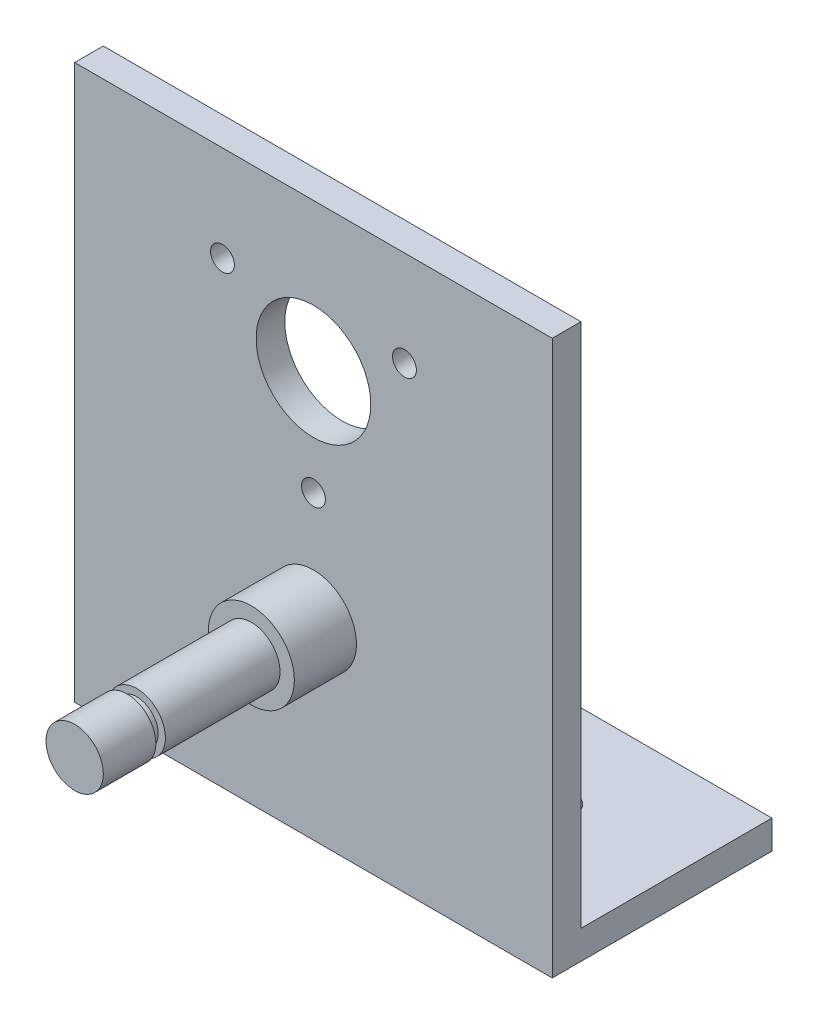
ISO-10303-21;
HEADER;
FILE_DESCRIPTION(('STEP AP214'),'2;1');
FILE_NAME('part.step','',(''),(''),'','','');
FILE_SCHEMA(('AUTOMOTIVE_DESIGN { 1 0 10303 214 1 1 1 1 }'));
ENDSEC;
DATA;
#1=APPLICATION_CONTEXT('core data for automotive mechanical design processes');
#2=APPLICATION_PROTOCOL_DEFINITION('international standard','automotive_design',2000,#1);
#3=PRODUCT_CONTEXT('',#1,'mechanical');
#4=PRODUCT('Part','Part','',(#3));
#5=PRODUCT_RELATED_PRODUCT_CATEGORY('part','',(#4));
#6=PRODUCT_DEFINITION_FORMATION('','',#4);
#7=PRODUCT_DEFINITION_CONTEXT('part definition',#1,'design');
#8=PRODUCT_DEFINITION('design','',#6,#7);
#9=PRODUCT_DEFINITION_SHAPE('','',#8);
#10=(LENGTH_UNIT() NAMED_UNIT(*) SI_UNIT(.MILLI.,.METRE.));
#11=(NAMED_UNIT(*) PLANE_ANGLE_UNIT() SI_UNIT($,.RADIAN.));
#12=(NAMED_UNIT(*) SI_UNIT($,.STERADIAN.) SOLID_ANGLE_UNIT());
#13=UNCERTAINTY_MEASURE_WITH_UNIT(LENGTH_MEASURE(1.E-05),#10,'distance_accuracy_value','');
#14=(GEOMETRIC_REPRESENTATION_CONTEXT(3) GLOBAL_UNCERTAINTY_ASSIGNED_CONTEXT((#13)) GLOBAL_UNIT_ASSIGNED_CONTEXT((#10,
#11,#12)) REPRESENTATION_CONTEXT('',''));
#15=CARTESIAN_POINT('',(0.,0.,0.));
#16=DIRECTION('',(0.,0.,1.));
#17=DIRECTION('',(1.,0.,0.));
#18=AXIS2_PLACEMENT_3D('',#15,#16,#17);
#19=CARTESIAN_POINT('',(-30.6196847846183,-1.48731281198003,28.));
#20=DIRECTION('',(0.,0.,-1.));
#21=DIRECTION('',(-1.,0.,0.));
#22=AXIS2_PLACEMENT_3D('',#19,#20,#21);
#23=CYLINDRICAL_SURFACE('',#22,3.);
#24=CARTESIAN_POINT('',(-30.6196847846183,-1.48731281198003,9.5));
#25=DIRECTION('',(0.,0.,1.));
#26=DIRECTION('',(1.,0.,0.));
#27=AXIS2_PLACEMENT_3D('',#24,#25,#26);
#28=CIRCLE('',#27,3.);
#29=CARTESIAN_POINT('',(-27.6196847846183,-1.48731281198003,9.5));
#30=VERTEX_POINT('',#29);
#31=EDGE_CURVE('E249',#30,#30,#28,.F.);
#32=ORIENTED_EDGE('',*,*,#31,.F.);
#33=EDGE_LOOP('',(#32));
#34=FACE_BOUND('',#33,.T.);
#35=CARTESIAN_POINT('',(-30.6196847846183,-1.48731281198003,21.5));
#36=DIRECTION('',(0.,0.,1.));
#37=DIRECTION('',(1.,0.,0.));
#38=AXIS2_PLACEMENT_3D('',#35,#36,#37);
#39=CIRCLE('',#38,3.);
#40=CARTESIAN_POINT('',(-27.6196847846183,-1.48731281198003,21.5));
#41=VERTEX_POINT('',#40);
#42=EDGE_CURVE('E246',#41,#41,#39,.T.);
#43=ORIENTED_EDGE('',*,*,#42,.F.);
#44=EDGE_LOOP('',(#43));
#45=FACE_BOUND('',#44,.T.);
#46=ADVANCED_FACE('F37',(#34,#45),#23,.T.);
#47=CARTESIAN_POINT('',(0.,0.,3.));
#48=DIRECTION('',(0.,0.,-1.));
#49=DIRECTION('',(-1.,0.,0.));
#50=AXIS2_PLACEMENT_3D('',#47,#48,#49);
#51=PLANE('',#50);
#52=CARTESIAN_POINT('',(-30.6196847846183,-1.48731281198003,2.9999999999859));
#53=DIRECTION('',(0.,0.,-1.));
#54=DIRECTION('',(-1.,0.,0.));
#55=AXIS2_PLACEMENT_3D('',#52,#53,#54);
#56=CIRCLE('',#55,4.5);
#57=CARTESIAN_POINT('',(-35.1196847846183,-1.48731281198003,2.9999999999859));
#58=VERTEX_POINT('',#57);
#59=EDGE_CURVE('E259',#58,#58,#56,.F.);
#60=ORIENTED_EDGE('',*,*,#59,.F.);
#61=EDGE_LOOP('',(#60));
#62=FACE_BOUND('',#61,.T.);
#63=CARTESIAN_POINT('',(-30.6196847846182,10.01268718802,3.));
#64=DIRECTION('',(0.,0.,1.));
#65=DIRECTION('',(1.,0.,0.));
#66=AXIS2_PLACEMENT_3D('',#63,#64,#65);
#67=CIRCLE('',#66,1.25);
#68=CARTESIAN_POINT('',(-29.3696847846182,10.01268718802,3.));
#69=VERTEX_POINT('',#68);
#70=EDGE_CURVE('E169',#69,#69,#67,.T.);
#71=ORIENTED_EDGE('',*,*,#70,.F.);
#72=EDGE_LOOP('',(#71));
#73=FACE_BOUND('',#72,.T.);
#74=CARTESIAN_POINT('',(-21.0934053429894,26.51268718802,3.));
#75=DIRECTION('',(0.,0.,1.));
#76=DIRECTION('',(1.,0.,0.));
#77=AXIS2_PLACEMENT_3D('',#74,#75,#76);
#78=CIRCLE('',#77,1.25);
#79=CARTESIAN_POINT('',(-19.8434053429894,26.51268718802,3.));
#80=VERTEX_POINT('',#79);
#81=EDGE_CURVE('E159',#80,#80,#78,.T.);
#82=ORIENTED_EDGE('',*,*,#81,.F.);
#83=EDGE_LOOP('',(#82));
#84=FACE_BOUND('',#83,.T.);
#85=CARTESIAN_POINT('',(-40.1459642262471,26.5126871880199,3.));
#86=DIRECTION('',(0.,0.,1.));
#87=DIRECTION('',(1.,0.,0.));
#88=AXIS2_PLACEMENT_3D('',#85,#86,#87);
#89=CIRCLE('',#88,1.25);
#90=CARTESIAN_POINT('',(-38.8959642262471,26.5126871880199,3.));
#91=VERTEX_POINT('',#90);
#92=EDGE_CURVE('E156',#91,#91,#89,.T.);
#93=ORIENTED_EDGE('',*,*,#92,.F.);
#94=EDGE_LOOP('',(#93));
#95=FACE_BOUND('',#94,.T.);
#96=CARTESIAN_POINT('',(-30.6196847846183,21.01268718802,3.));
#97=DIRECTION('',(0.,0.,1.));
#98=DIRECTION('',(1.,0.,0.));
#99=AXIS2_PLACEMENT_3D('',#96,#97,#98);
#100=CIRCLE('',#99,6.);
#101=CARTESIAN_POINT('',(-24.6196847846183,21.01268718802,3.));
#102=VERTEX_POINT('',#101);
#103=EDGE_CURVE('E152',#102,#102,#100,.T.);
#104=ORIENTED_EDGE('',*,*,#103,.F.);
#105=EDGE_LOOP('',(#104));
#106=FACE_BOUND('',#105,.T.);
#107=DIRECTION('',(0.,-1.,0.));
#108=VECTOR('',#107,1.);
#109=CARTESIAN_POINT('',(-55.6196847846183,-21.48731281198,3.));
#110=LINE('',#109,#108);
#111=CARTESIAN_POINT('',(-55.6196847846183,36.51268718802,3.));
#112=VERTEX_POINT('',#111);
#113=CARTESIAN_POINT('',(-55.6196847846183,-21.48731281198,3.));
#114=VERTEX_POINT('',#113);
#115=EDGE_CURVE('E133',#112,#114,#110,.T.);
#116=ORIENTED_EDGE('',*,*,#115,.T.);
#117=DIRECTION('',(1.,0.,0.));
#118=VECTOR('',#117,1.);
#119=CARTESIAN_POINT('',(-55.6196847846183,-21.48731281198,3.));
#120=LINE('',#119,#118);
#121=CARTESIAN_POINT('',(-5.61968478461826,-21.48731281198,3.));
#122=VERTEX_POINT('',#121);
#123=EDGE_CURVE('E85',#114,#122,#120,.T.);
#124=ORIENTED_EDGE('',*,*,#123,.T.);
#125=DIRECTION('',(0.,1.,0.));
#126=VECTOR('',#125,1.);
#127=CARTESIAN_POINT('',(-5.61968478461826,-21.48731281198,3.));
#128=LINE('',#127,#126);
#129=CARTESIAN_POINT('',(-5.61968478461826,36.51268718802,3.));
#130=VERTEX_POINT('',#129);
#131=EDGE_CURVE('E107',#122,#130,#128,.T.);
#132=ORIENTED_EDGE('',*,*,#131,.T.);
#133=DIRECTION('',(-1.,0.,0.));
#134=VECTOR('',#133,1.);
#135=CARTESIAN_POINT('',(-55.6196847846183,36.51268718802,3.));
#136=LINE('',#135,#134);
#137=EDGE_CURVE('E63',#130,#112,#136,.T.);
#138=ORIENTED_EDGE('',*,*,#137,.T.);
#139=EDGE_LOOP('',(#116,#124,#132,#138));
#140=FACE_BOUND('',#139,.T.);
#141=ADVANCED_FACE('F188',(#62,#73,#84,#95,#106,#140),#51,.F.);
#142=CARTESIAN_POINT('',(-55.6196847846183,-21.48731281198,3.));
#143=DIRECTION('',(1.,0.,0.));
#144=DIRECTION('',(0.,0.,-1.));
#145=AXIS2_PLACEMENT_3D('',#142,#143,#144);
#146=PLANE('',#145);
#147=DIRECTION('',(0.,-1.,0.));
#148=VECTOR('',#147,1.);
#149=CARTESIAN_POINT('',(-55.6196847846183,-21.48731281198,0.));
#150=LINE('',#149,#148);
#151=CARTESIAN_POINT('',(-55.6196847846183,36.51268718802,0.));
#152=VERTEX_POINT('',#151);
#153=CARTESIAN_POINT('',(-55.6196847846183,-18.48731281198,0.));
#154=VERTEX_POINT('',#153);
#155=EDGE_CURVE('E146',#152,#154,#150,.T.);
#156=ORIENTED_EDGE('',*,*,#155,.T.);
#157=DIRECTION('',(0.,0.,1.));
#158=VECTOR('',#157,1.);
#159=CARTESIAN_POINT('',(-55.6196847846183,-18.48731281198,-20.));
#160=LINE('',#159,#158);
#161=CARTESIAN_POINT('',(-55.6196847846183,-18.48731281198,-20.));
#162=VERTEX_POINT('',#161);
#163=EDGE_CURVE('E141',#162,#154,#160,.T.);
#164=ORIENTED_EDGE('',*,*,#163,.F.);
#165=DIRECTION('',(0.,1.,0.));
#166=VECTOR('',#165,1.);
#167=CARTESIAN_POINT('',(-55.6196847846183,-21.48731281198,-20.));
#168=LINE('',#167,#166);
#169=CARTESIAN_POINT('',(-55.6196847846183,-21.48731281198,-20.));
#170=VERTEX_POINT('',#169);
#171=EDGE_CURVE('E116',#170,#162,#168,.T.);
#172=ORIENTED_EDGE('',*,*,#171,.F.);
#173=DIRECTION('',(0.,0.,-1.));
#174=VECTOR('',#173,1.);
#175=CARTESIAN_POINT('',(-55.6196847846183,-21.48731281198,3.));
#176=LINE('',#175,#174);
#177=EDGE_CURVE('E11',#114,#170,#176,.T.);
#178=ORIENTED_EDGE('',*,*,#177,.F.);
#179=ORIENTED_EDGE('',*,*,#115,.F.);
#180=DIRECTION('',(0.,0.,-1.));
#181=VECTOR('',#180,1.);
#182=CARTESIAN_POINT('',(-55.6196847846183,36.51268718802,3.));
#183=LINE('',#182,#181);
#184=EDGE_CURVE('E198',#112,#152,#183,.T.);
#185=ORIENTED_EDGE('',*,*,#184,.T.);
#186=EDGE_LOOP('',(#156,#164,#172,#178,#179,#185));
#187=FACE_BOUND('',#186,.T.);
#188=ADVANCED_FACE('F39',(#187),#146,.F.);
#189=CARTESIAN_POINT('',(-55.6196847846183,-21.48731281198,3.));
#190=DIRECTION('',(0.,1.,0.));
#191=DIRECTION('',(0.,0.,1.));
#192=AXIS2_PLACEMENT_3D('',#189,#190,#191);
#193=PLANE('',#192);
#194=CARTESIAN_POINT('',(-43.1196847846183,-21.48731281198,-10.));
#195=DIRECTION('',(0.,1.,0.));
#196=DIRECTION('',(-1.,0.,0.));
#197=AXIS2_PLACEMENT_3D('',#194,#195,#196);
#198=CIRCLE('',#197,1.9);
#199=CARTESIAN_POINT('',(-45.0196847846183,-21.48731281198,-10.));
#200=VERTEX_POINT('',#199);
#201=EDGE_CURVE('E173',#200,#200,#198,.T.);
#202=ORIENTED_EDGE('',*,*,#201,.T.);
#203=EDGE_LOOP('',(#202));
#204=FACE_BOUND('',#203,.T.);
#205=CARTESIAN_POINT('',(-18.1196847846183,-21.48731281198,-10.));
#206=DIRECTION('',(0.,1.,0.));
#207=DIRECTION('',(-1.,0.,0.));
#208=AXIS2_PLACEMENT_3D('',#205,#206,#207);
#209=CIRCLE('',#208,1.9);
#210=CARTESIAN_POINT('',(-20.0196847846183,-21.48731281198,-10.));
#211=VERTEX_POINT('',#210);
#212=EDGE_CURVE('E179',#211,#211,#209,.T.);
#213=ORIENTED_EDGE('',*,*,#212,.T.);
#214=EDGE_LOOP('',(#213));
#215=FACE_BOUND('',#214,.T.);
#216=ORIENTED_EDGE('',*,*,#177,.T.);
#217=DIRECTION('',(-1.,0.,0.));
#218=VECTOR('',#217,1.);
#219=CARTESIAN_POINT('',(-5.61968478461826,-21.48731281198,-20.));
#220=LINE('',#219,#218);
#221=CARTESIAN_POINT('',(-5.61968478461826,-21.48731281198,-20.));
#222=VERTEX_POINT('',#221);
#223=EDGE_CURVE('E111',#222,#170,#220,.T.);
#224=ORIENTED_EDGE('',*,*,#223,.F.);
#225=DIRECTION('',(0.,0.,-1.));
#226=VECTOR('',#225,1.);
#227=CARTESIAN_POINT('',(-5.61968478461826,-21.48731281198,3.));
#228=LINE('',#227,#226);
#229=EDGE_CURVE('E46',#122,#222,#228,.T.);
#230=ORIENTED_EDGE('',*,*,#229,.F.);
#231=ORIENTED_EDGE('',*,*,#123,.F.);
#232=EDGE_LOOP('',(#216,#224,#230,#231));
#233=FACE_BOUND('',#232,.T.);
#234=ADVANCED_FACE('F112',(#204,#215,#233),#193,.F.);
#235=CARTESIAN_POINT('',(-5.61968478461826,-21.48731281198,3.));
#236=DIRECTION('',(-1.,0.,0.));
#237=DIRECTION('',(0.,0.,1.));
#238=AXIS2_PLACEMENT_3D('',#235,#236,#237);
#239=PLANE('',#238);
#240=ORIENTED_EDGE('',*,*,#229,.T.);
#241=DIRECTION('',(0.,-1.,0.));
#242=VECTOR('',#241,1.);
#243=CARTESIAN_POINT('',(-5.61968478461826,-21.48731281198,-20.));
#244=LINE('',#243,#242);
#245=CARTESIAN_POINT('',(-5.61968478461826,-18.48731281198,-20.));
#246=VERTEX_POINT('',#245);
#247=EDGE_CURVE('E105',#246,#222,#244,.T.);
#248=ORIENTED_EDGE('',*,*,#247,.F.);
#249=DIRECTION('',(0.,0.,1.));
#250=VECTOR('',#249,1.);
#251=CARTESIAN_POINT('',(-5.61968478461826,-18.48731281198,-20.));
#252=LINE('',#251,#250);
#253=CARTESIAN_POINT('',(-5.61968478461826,-18.48731281198,0.));
#254=VERTEX_POINT('',#253);
#255=EDGE_CURVE('E130',#246,#254,#252,.T.);
#256=ORIENTED_EDGE('',*,*,#255,.T.);
#257=DIRECTION('',(0.,1.,0.));
#258=VECTOR('',#257,1.);
#259=CARTESIAN_POINT('',(-5.61968478461826,-21.48731281198,0.));
#260=LINE('',#259,#258);
#261=CARTESIAN_POINT('',(-5.61968478461826,36.51268718802,0.));
#262=VERTEX_POINT('',#261);
#263=EDGE_CURVE('E137',#254,#262,#260,.T.);
#264=ORIENTED_EDGE('',*,*,#263,.T.);
#265=DIRECTION('',(0.,0.,-1.));
#266=VECTOR('',#265,1.);
#267=CARTESIAN_POINT('',(-5.61968478461826,36.51268718802,3.));
#268=LINE('',#267,#266);
#269=EDGE_CURVE('E108',#130,#262,#268,.T.);
#270=ORIENTED_EDGE('',*,*,#269,.F.);
#271=ORIENTED_EDGE('',*,*,#131,.F.);
#272=EDGE_LOOP('',(#240,#248,#256,#264,#270,#271));
#273=FACE_BOUND('',#272,.T.);
#274=ADVANCED_FACE('F102',(#273),#239,.F.);
#275=CARTESIAN_POINT('',(-55.6196847846183,36.51268718802,3.));
#276=DIRECTION('',(0.,-1.,0.));
#277=DIRECTION('',(0.,0.,-1.));
#278=AXIS2_PLACEMENT_3D('',#275,#276,#277);
#279=PLANE('',#278);
#280=DIRECTION('',(-1.,0.,0.));
#281=VECTOR('',#280,1.);
#282=CARTESIAN_POINT('',(-55.6196847846183,36.51268718802,0.));
#283=LINE('',#282,#281);
#284=EDGE_CURVE('E78',#262,#152,#283,.T.);
#285=ORIENTED_EDGE('',*,*,#284,.T.);
#286=ORIENTED_EDGE('',*,*,#184,.F.);
#287=ORIENTED_EDGE('',*,*,#137,.F.);
#288=ORIENTED_EDGE('',*,*,#269,.T.);
#289=EDGE_LOOP('',(#285,#286,#287,#288));
#290=FACE_BOUND('',#289,.T.);
#291=ADVANCED_FACE('F197',(#290),#279,.F.);
#292=CARTESIAN_POINT('',(0.,0.,0.));
#293=DIRECTION('',(0.,0.,-1.));
#294=DIRECTION('',(-1.,0.,0.));
#295=AXIS2_PLACEMENT_3D('',#292,#293,#294);
#296=PLANE('',#295);
#297=CARTESIAN_POINT('',(-30.6196847846182,10.01268718802,0.));
#298=DIRECTION('',(0.,0.,-1.));
#299=DIRECTION('',(-1.,0.,0.));
#300=AXIS2_PLACEMENT_3D('',#297,#298,#299);
#301=CIRCLE('',#300,1.25);
#302=CARTESIAN_POINT('',(-31.8696847846182,10.01268718802,0.));
#303=VERTEX_POINT('',#302);
#304=EDGE_CURVE('E41',#303,#303,#301,.T.);
#305=ORIENTED_EDGE('',*,*,#304,.F.);
#306=EDGE_LOOP('',(#305));
#307=FACE_BOUND('',#306,.T.);
#308=CARTESIAN_POINT('',(-21.0934053429894,26.51268718802,0.));
#309=DIRECTION('',(0.,0.,-1.));
#310=DIRECTION('',(-1.,0.,0.));
#311=AXIS2_PLACEMENT_3D('',#308,#309,#310);
#312=CIRCLE('',#311,1.25);
#313=CARTESIAN_POINT('',(-22.3434053429894,26.51268718802,0.));
#314=VERTEX_POINT('',#313);
#315=EDGE_CURVE('E157',#314,#314,#312,.T.);
#316=ORIENTED_EDGE('',*,*,#315,.F.);
#317=EDGE_LOOP('',(#316));
#318=FACE_BOUND('',#317,.T.);
#319=CARTESIAN_POINT('',(-40.1459642262471,26.5126871880199,0.));
#320=DIRECTION('',(0.,0.,-1.));
#321=DIRECTION('',(-1.,0.,0.));
#322=AXIS2_PLACEMENT_3D('',#319,#320,#321);
#323=CIRCLE('',#322,1.25);
#324=CARTESIAN_POINT('',(-41.3959642262471,26.5126871880199,0.));
#325=VERTEX_POINT('',#324);
#326=EDGE_CURVE('E153',#325,#325,#323,.T.);
#327=ORIENTED_EDGE('',*,*,#326,.F.);
#328=EDGE_LOOP('',(#327));
#329=FACE_BOUND('',#328,.T.);
#330=CARTESIAN_POINT('',(-30.6196847846183,21.01268718802,0.));
#331=DIRECTION('',(0.,0.,-1.));
#332=DIRECTION('',(-1.,0.,0.));
#333=AXIS2_PLACEMENT_3D('',#330,#331,#332);
#334=CIRCLE('',#333,6.);
#335=CARTESIAN_POINT('',(-36.6196847846183,21.01268718802,0.));
#336=VERTEX_POINT('',#335);
#337=EDGE_CURVE('E149',#336,#336,#334,.T.);
#338=ORIENTED_EDGE('',*,*,#337,.F.);
#339=EDGE_LOOP('',(#338));
#340=FACE_BOUND('',#339,.T.);
#341=DIRECTION('',(1.,0.,0.));
#342=VECTOR('',#341,1.);
#343=CARTESIAN_POINT('',(-5.61968478461826,-18.48731281198,0.));
#344=LINE('',#343,#342);
#345=EDGE_CURVE('E54',#154,#254,#344,.T.);
#346=ORIENTED_EDGE('',*,*,#345,.F.);
#347=ORIENTED_EDGE('',*,*,#155,.F.);
#348=ORIENTED_EDGE('',*,*,#284,.F.);
#349=ORIENTED_EDGE('',*,*,#263,.F.);
#350=EDGE_LOOP('',(#346,#347,#348,#349));
#351=FACE_BOUND('',#350,.T.);
#352=ADVANCED_FACE('F200',(#307,#318,#329,#340,#351),#296,.T.);
#353=CARTESIAN_POINT('',(-5.61968478461826,-18.48731281198,-20.));
#354=DIRECTION('',(0.,-1.,0.));
#355=DIRECTION('',(1.,0.,0.));
#356=AXIS2_PLACEMENT_3D('',#353,#354,#355);
#357=PLANE('',#356);
#358=CARTESIAN_POINT('',(-43.1196847846183,-18.48731281198,-10.));
#359=DIRECTION('',(0.,1.,0.));
#360=DIRECTION('',(-1.,0.,0.));
#361=AXIS2_PLACEMENT_3D('',#358,#359,#360);
#362=CIRCLE('',#361,1.9);
#363=CARTESIAN_POINT('',(-45.0196847846183,-18.48731281198,-10.));
#364=VERTEX_POINT('',#363);
#365=EDGE_CURVE('E155',#364,#364,#362,.T.);
#366=ORIENTED_EDGE('',*,*,#365,.F.);
#367=EDGE_LOOP('',(#366));
#368=FACE_BOUND('',#367,.T.);
#369=CARTESIAN_POINT('',(-18.1196847846183,-18.48731281198,-10.));
#370=DIRECTION('',(0.,1.,0.));
#371=DIRECTION('',(-1.,0.,0.));
#372=AXIS2_PLACEMENT_3D('',#369,#370,#371);
#373=CIRCLE('',#372,1.9);
#374=CARTESIAN_POINT('',(-20.0196847846183,-18.48731281198,-10.));
#375=VERTEX_POINT('',#374);
#376=EDGE_CURVE('E176',#375,#375,#373,.T.);
#377=ORIENTED_EDGE('',*,*,#376,.F.);
#378=EDGE_LOOP('',(#377));
#379=FACE_BOUND('',#378,.T.);
#380=ORIENTED_EDGE('',*,*,#345,.T.);
#381=ORIENTED_EDGE('',*,*,#255,.F.);
#382=DIRECTION('',(1.,0.,0.));
#383=VECTOR('',#382,1.);
#384=CARTESIAN_POINT('',(-5.61968478461826,-18.48731281198,-20.));
#385=LINE('',#384,#383);
#386=EDGE_CURVE('E120',#162,#246,#385,.T.);
#387=ORIENTED_EDGE('',*,*,#386,.F.);
#388=ORIENTED_EDGE('',*,*,#163,.T.);
#389=EDGE_LOOP('',(#380,#381,#387,#388));
#390=FACE_BOUND('',#389,.T.);
#391=ADVANCED_FACE('F196',(#368,#379,#390),#357,.F.);
#392=CARTESIAN_POINT('',(0.,0.,-20.));
#393=DIRECTION('',(0.,0.,1.));
#394=DIRECTION('',(1.,0.,0.));
#395=AXIS2_PLACEMENT_3D('',#392,#393,#394);
#396=PLANE('',#395);
#397=ORIENTED_EDGE('',*,*,#247,.T.);
#398=ORIENTED_EDGE('',*,*,#223,.T.);
#399=ORIENTED_EDGE('',*,*,#171,.T.);
#400=ORIENTED_EDGE('',*,*,#386,.T.);
#401=EDGE_LOOP('',(#397,#398,#399,#400));
#402=FACE_BOUND('',#401,.T.);
#403=ADVANCED_FACE('F118',(#402),#396,.F.);
#404=CARTESIAN_POINT('',(-30.6196847846183,21.01268718802,-20.000025));
#405=DIRECTION('',(0.,0.,1.));
#406=DIRECTION('',(1.,0.,0.));
#407=AXIS2_PLACEMENT_3D('',#404,#405,#406);
#408=CYLINDRICAL_SURFACE('',#407,6.);
#409=ORIENTED_EDGE('',*,*,#337,.T.);
#410=EDGE_LOOP('',(#409));
#411=FACE_BOUND('',#410,.T.);
#412=ORIENTED_EDGE('',*,*,#103,.T.);
#413=EDGE_LOOP('',(#412));
#414=FACE_BOUND('',#413,.T.);
#415=ADVANCED_FACE('F186',(#411,#414),#408,.F.);
#416=CARTESIAN_POINT('',(-18.1196847846183,-21.48731281198,-10.));
#417=DIRECTION('',(0.,1.,0.));
#418=DIRECTION('',(-1.,0.,0.));
#419=AXIS2_PLACEMENT_3D('',#416,#417,#418);
#420=CYLINDRICAL_SURFACE('',#419,1.9);
#421=ORIENTED_EDGE('',*,*,#212,.F.);
#422=EDGE_LOOP('',(#421));
#423=FACE_BOUND('',#422,.T.);
#424=ORIENTED_EDGE('',*,*,#376,.T.);
#425=EDGE_LOOP('',(#424));
#426=FACE_BOUND('',#425,.T.);
#427=ADVANCED_FACE('F283',(#423,#426),#420,.F.);
#428=CARTESIAN_POINT('',(-43.1196847846183,-21.48731281198,-10.));
#429=DIRECTION('',(0.,1.,0.));
#430=DIRECTION('',(-1.,0.,0.));
#431=AXIS2_PLACEMENT_3D('',#428,#429,#430);
#432=CYLINDRICAL_SURFACE('',#431,1.9);
#433=ORIENTED_EDGE('',*,*,#201,.F.);
#434=EDGE_LOOP('',(#433));
#435=FACE_BOUND('',#434,.T.);
#436=ORIENTED_EDGE('',*,*,#365,.T.);
#437=EDGE_LOOP('',(#436));
#438=FACE_BOUND('',#437,.T.);
#439=ADVANCED_FACE('F275',(#435,#438),#432,.F.);
#440=CARTESIAN_POINT('',(-40.1459642262471,26.5126871880199,-7.));
#441=DIRECTION('',(0.,0.,1.));
#442=DIRECTION('',(1.,0.,0.));
#443=AXIS2_PLACEMENT_3D('',#440,#441,#442);
#444=CYLINDRICAL_SURFACE('',#443,1.25);
#445=ORIENTED_EDGE('',*,*,#326,.T.);
#446=EDGE_LOOP('',(#445));
#447=FACE_BOUND('',#446,.T.);
#448=ORIENTED_EDGE('',*,*,#92,.T.);
#449=EDGE_LOOP('',(#448));
#450=FACE_BOUND('',#449,.T.);
#451=ADVANCED_FACE('F272',(#447,#450),#444,.F.);
#452=CARTESIAN_POINT('',(-21.0934053429894,26.51268718802,-7.));
#453=DIRECTION('',(0.,0.,1.));
#454=DIRECTION('',(1.,0.,0.));
#455=AXIS2_PLACEMENT_3D('',#452,#453,#454);
#456=CYLINDRICAL_SURFACE('',#455,1.25);
#457=ORIENTED_EDGE('',*,*,#315,.T.);
#458=EDGE_LOOP('',(#457));
#459=FACE_BOUND('',#458,.T.);
#460=ORIENTED_EDGE('',*,*,#81,.T.);
#461=EDGE_LOOP('',(#460));
#462=FACE_BOUND('',#461,.T.);
#463=ADVANCED_FACE('F274',(#459,#462),#456,.F.);
#464=CARTESIAN_POINT('',(-30.6196847846182,10.01268718802,-7.));
#465=DIRECTION('',(0.,0.,1.));
#466=DIRECTION('',(1.,0.,0.));
#467=AXIS2_PLACEMENT_3D('',#464,#465,#466);
#468=CYLINDRICAL_SURFACE('',#467,1.25);
#469=ORIENTED_EDGE('',*,*,#304,.T.);
#470=EDGE_LOOP('',(#469));
#471=FACE_BOUND('',#470,.T.);
#472=ORIENTED_EDGE('',*,*,#70,.T.);
#473=EDGE_LOOP('',(#472));
#474=FACE_BOUND('',#473,.T.);
#475=ADVANCED_FACE('F266',(#471,#474),#468,.F.);
#476=CARTESIAN_POINT('',(-30.6196847846183,-1.48731281198003,-500000.));
#477=DIRECTION('',(0.,0.,1.));
#478=DIRECTION('',(1.,0.,0.));
#479=AXIS2_PLACEMENT_3D('',#476,#477,#478);
#480=CYLINDRICAL_SURFACE('',#479,4.5);
#481=CARTESIAN_POINT('',(-30.6196847846183,-1.48731281198003,9.5));
#482=DIRECTION('',(0.,0.,1.));
#483=DIRECTION('',(1.,0.,0.));
#484=AXIS2_PLACEMENT_3D('',#481,#482,#483);
#485=CIRCLE('',#484,4.5);
#486=CARTESIAN_POINT('',(-26.1196847846183,-1.48731281198003,9.5));
#487=VERTEX_POINT('',#486);
#488=EDGE_CURVE('E245',#487,#487,#485,.T.);
#489=ORIENTED_EDGE('',*,*,#488,.F.);
#490=EDGE_LOOP('',(#489));
#491=FACE_BOUND('',#490,.T.);
#492=ORIENTED_EDGE('',*,*,#59,.T.);
#493=EDGE_LOOP('',(#492));
#494=FACE_BOUND('',#493,.T.);
#495=ADVANCED_FACE('F349',(#491,#494),#480,.T.);
#496=CARTESIAN_POINT('',(-30.6196847846183,-1.48731281198003,9.5));
#497=DIRECTION('',(0.,0.,1.));
#498=DIRECTION('',(1.,0.,0.));
#499=AXIS2_PLACEMENT_3D('',#496,#497,#498);
#500=PLANE('',#499);
#501=ORIENTED_EDGE('',*,*,#488,.T.);
#502=EDGE_LOOP('',(#501));
#503=FACE_BOUND('',#502,.T.);
#504=ORIENTED_EDGE('',*,*,#31,.T.);
#505=EDGE_LOOP('',(#504));
#506=FACE_BOUND('',#505,.T.);
#507=ADVANCED_FACE('F366',(#503,#506),#500,.T.);
#508=CARTESIAN_POINT('',(-30.6196847846183,-1.48731281198003,22.5));
#509=DIRECTION('',(0.,0.,1.));
#510=DIRECTION('',(1.,0.,0.));
#511=AXIS2_PLACEMENT_3D('',#508,#509,#510);
#512=PLANE('',#511);
#513=CARTESIAN_POINT('',(-30.6196847846183,-1.48731281198003,22.5));
#514=DIRECTION('',(0.,0.,1.));
#515=DIRECTION('',(1.,0.,0.));
#516=AXIS2_PLACEMENT_3D('',#513,#514,#515);
#517=CIRCLE('',#516,3.);
#518=CARTESIAN_POINT('',(-27.6196847846183,-1.48731281198003,22.5));
#519=VERTEX_POINT('',#518);
#520=EDGE_CURVE('E241',#519,#519,#517,.T.);
#521=ORIENTED_EDGE('',*,*,#520,.F.);
#522=EDGE_LOOP('',(#521));
#523=FACE_BOUND('',#522,.T.);
#524=CARTESIAN_POINT('',(-30.6196847846183,-1.48731281198003,22.5));
#525=DIRECTION('',(0.,0.,1.));
#526=DIRECTION('',(1.,0.,0.));
#527=AXIS2_PLACEMENT_3D('',#524,#525,#526);
#528=CIRCLE('',#527,2.25000000000001);
#529=CARTESIAN_POINT('',(-28.3696847846183,-1.48731281198003,22.5));
#530=VERTEX_POINT('',#529);
#531=EDGE_CURVE('E252',#530,#530,#528,.T.);
#532=ORIENTED_EDGE('',*,*,#531,.T.);
#533=EDGE_LOOP('',(#532));
#534=FACE_BOUND('',#533,.T.);
#535=ADVANCED_FACE('F375',(#523,#534),#512,.F.);
#536=CARTESIAN_POINT('',(-30.6196847846183,-1.48731281198003,21.5));
#537=DIRECTION('',(0.,0.,1.));
#538=DIRECTION('',(1.,0.,0.));
#539=AXIS2_PLACEMENT_3D('',#536,#537,#538);
#540=PLANE('',#539);
#541=ORIENTED_EDGE('',*,*,#42,.T.);
#542=EDGE_LOOP('',(#541));
#543=FACE_BOUND('',#542,.T.);
#544=CARTESIAN_POINT('',(-30.6196847846183,-1.48731281198003,21.5));
#545=DIRECTION('',(0.,0.,1.));
#546=DIRECTION('',(1.,0.,0.));
#547=AXIS2_PLACEMENT_3D('',#544,#545,#546);
#548=CIRCLE('',#547,2.25000000000001);
#549=CARTESIAN_POINT('',(-28.3696847846183,-1.48731281198003,21.5));
#550=VERTEX_POINT('',#549);
#551=EDGE_CURVE('E255',#550,#550,#548,.T.);
#552=ORIENTED_EDGE('',*,*,#551,.F.);
#553=EDGE_LOOP('',(#552));
#554=FACE_BOUND('',#553,.T.);
#555=ADVANCED_FACE('F390',(#543,#554),#540,.T.);
#556=CARTESIAN_POINT('',(-30.6196847846183,-1.48731281198003,22.5));
#557=DIRECTION('',(0.,0.,-1.));
#558=DIRECTION('',(-1.,0.,0.));
#559=AXIS2_PLACEMENT_3D('',#556,#557,#558);
#560=CYLINDRICAL_SURFACE('',#559,2.25000000000001);
#561=ORIENTED_EDGE('',*,*,#531,.F.);
#562=EDGE_LOOP('',(#561));
#563=FACE_BOUND('',#562,.T.);
#564=ORIENTED_EDGE('',*,*,#551,.T.);
#565=EDGE_LOOP('',(#564));
#566=FACE_BOUND('',#565,.T.);
#567=ADVANCED_FACE('F236',(#563,#566),#560,.T.);
#568=CARTESIAN_POINT('',(-30.6196847846183,-1.48731281198003,28.));
#569=DIRECTION('',(0.,0.,1.));
#570=DIRECTION('',(1.,0.,0.));
#571=AXIS2_PLACEMENT_3D('',#568,#569,#570);
#572=PLANE('',#571);
#573=CARTESIAN_POINT('',(-30.6196847846183,-1.48731281198003,28.));
#574=DIRECTION('',(0.,0.,1.));
#575=DIRECTION('',(1.,0.,0.));
#576=AXIS2_PLACEMENT_3D('',#573,#574,#575);
#577=CIRCLE('',#576,3.);
#578=CARTESIAN_POINT('',(-27.6196847846183,-1.48731281198003,28.));
#579=VERTEX_POINT('',#578);
#580=EDGE_CURVE('E123',#579,#579,#577,.T.);
#581=ORIENTED_EDGE('',*,*,#580,.T.);
#582=EDGE_LOOP('',(#581));
#583=FACE_BOUND('',#582,.T.);
#584=ADVANCED_FACE('F231',(#583),#572,.T.);
#585=ORIENTED_EDGE('',*,*,#520,.T.);
#586=EDGE_LOOP('',(#585));
#587=FACE_BOUND('',#586,.T.);
#588=ORIENTED_EDGE('',*,*,#580,.F.);
#589=EDGE_LOOP('',(#588));
#590=FACE_BOUND('',#589,.T.);
#591=ADVANCED_FACE('F223',(#587,#590),#23,.T.);
#592=CLOSED_SHELL('',(#46,#141,#188,#234,#274,#291,#352,#391,#403,#415,#427,#439,#451,#463,#475,
#495,#507,#535,#555,#567,#584,#591));
#593=MANIFOLD_SOLID_BREP('B2',#592);
#594=ADVANCED_BREP_SHAPE_REPRESENTATION('',(#18,#593),#14);
#595=SHAPE_DEFINITION_REPRESENTATION(#9,#594);
ENDSEC;
END-ISO-10303-21;
